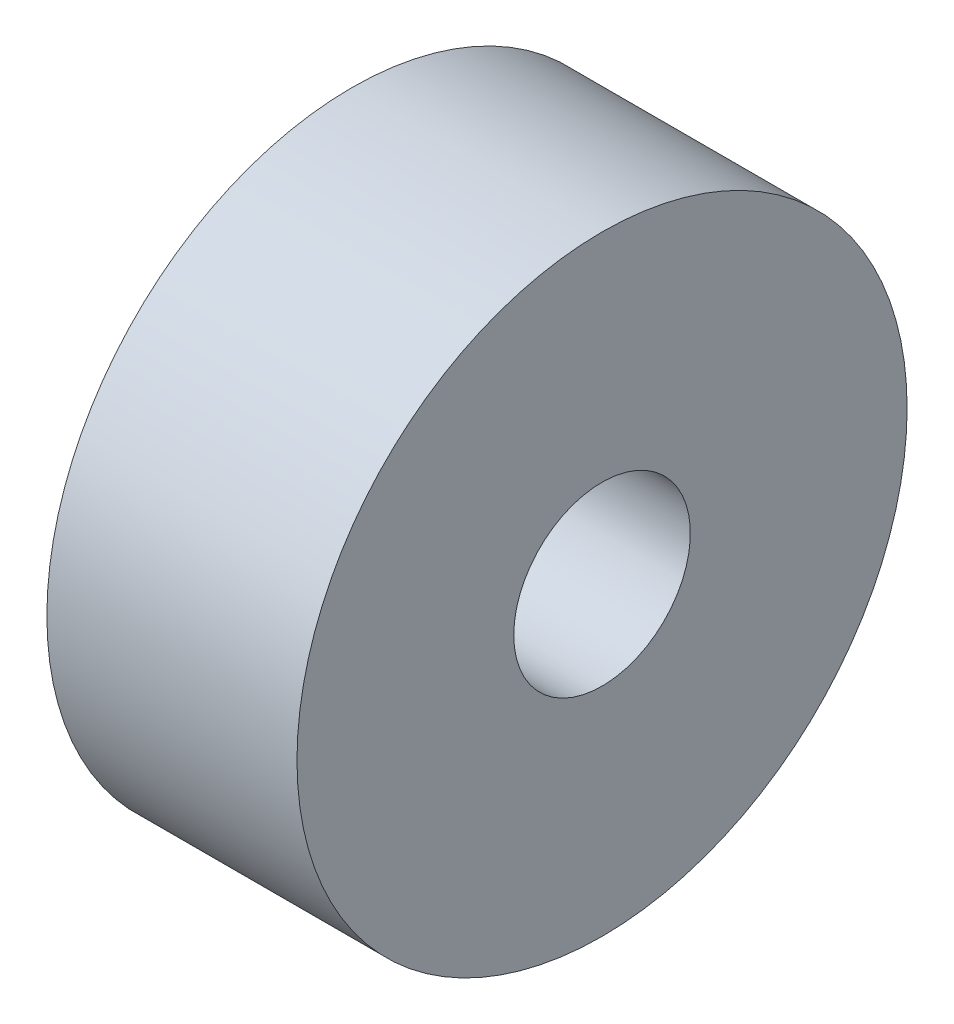
ISO-10303-21;
HEADER;
FILE_DESCRIPTION(('STEP AP214'),'2;1');
FILE_NAME('part.step','',(''),(''),'','','');
FILE_SCHEMA(('AUTOMOTIVE_DESIGN { 1 0 10303 214 1 1 1 1 }'));
ENDSEC;
DATA;
#1=APPLICATION_CONTEXT('core data for automotive mechanical design processes');
#2=APPLICATION_PROTOCOL_DEFINITION('international standard','automotive_design',2000,#1);
#3=PRODUCT_CONTEXT('',#1,'mechanical');
#4=PRODUCT('Part','Part','',(#3));
#5=PRODUCT_RELATED_PRODUCT_CATEGORY('part','',(#4));
#6=PRODUCT_DEFINITION_FORMATION('','',#4);
#7=PRODUCT_DEFINITION_CONTEXT('part definition',#1,'design');
#8=PRODUCT_DEFINITION('design','',#6,#7);
#9=PRODUCT_DEFINITION_SHAPE('','',#8);
#10=(LENGTH_UNIT() NAMED_UNIT(*) SI_UNIT(.MILLI.,.METRE.));
#11=(NAMED_UNIT(*) PLANE_ANGLE_UNIT() SI_UNIT($,.RADIAN.));
#12=(NAMED_UNIT(*) SI_UNIT($,.STERADIAN.) SOLID_ANGLE_UNIT());
#13=UNCERTAINTY_MEASURE_WITH_UNIT(LENGTH_MEASURE(1.E-05),#10,'distance_accuracy_value','');
#14=(GEOMETRIC_REPRESENTATION_CONTEXT(3) GLOBAL_UNCERTAINTY_ASSIGNED_CONTEXT((#13)) GLOBAL_UNIT_ASSIGNED_CONTEXT((#10,
#11,#12)) REPRESENTATION_CONTEXT('',''));
#15=CARTESIAN_POINT('',(0.,0.,0.));
#16=DIRECTION('',(0.,0.,1.));
#17=DIRECTION('',(1.,0.,0.));
#18=AXIS2_PLACEMENT_3D('',#15,#16,#17);
#19=CARTESIAN_POINT('',(0.,0.,0.));
#20=DIRECTION('',(1.,0.,0.));
#21=DIRECTION('',(0.,0.,-1.));
#22=AXIS2_PLACEMENT_3D('',#19,#20,#21);
#23=PLANE('',#22);
#24=CARTESIAN_POINT('',(0.,0.,0.));
#25=DIRECTION('',(-1.,0.,0.));
#26=DIRECTION('',(0.,0.,1.));
#27=AXIS2_PLACEMENT_3D('',#24,#25,#26);
#28=CIRCLE('',#27,1.5875);
#29=CARTESIAN_POINT('',(0.,0.,1.5875));
#30=VERTEX_POINT('',#29);
#31=EDGE_CURVE('E27',#30,#30,#28,.F.);
#32=ORIENTED_EDGE('',*,*,#31,.T.);
#33=EDGE_LOOP('',(#32));
#34=FACE_BOUND('',#33,.T.);
#35=CARTESIAN_POINT('',(0.,0.,0.));
#36=DIRECTION('',(-1.,0.,0.));
#37=DIRECTION('',(0.,0.,1.));
#38=AXIS2_PLACEMENT_3D('',#35,#36,#37);
#39=CIRCLE('',#38,5.4839997);
#40=CARTESIAN_POINT('',(0.,0.,5.4839997));
#41=VERTEX_POINT('',#40);
#42=EDGE_CURVE('E18',#41,#41,#39,.F.);
#43=ORIENTED_EDGE('',*,*,#42,.F.);
#44=EDGE_LOOP('',(#43));
#45=FACE_BOUND('',#44,.T.);
#46=ADVANCED_FACE('F15',(#34,#45),#23,.F.);
#47=CARTESIAN_POINT('',(4.4958,0.,0.));
#48=DIRECTION('',(-1.,0.,0.));
#49=DIRECTION('',(0.,0.,1.));
#50=AXIS2_PLACEMENT_3D('',#47,#48,#49);
#51=CYLINDRICAL_SURFACE('',#50,5.4839997);
#52=ORIENTED_EDGE('',*,*,#42,.T.);
#53=EDGE_LOOP('',(#52));
#54=FACE_BOUND('',#53,.T.);
#55=CARTESIAN_POINT('',(4.4958,0.,0.));
#56=DIRECTION('',(-1.,0.,0.));
#57=DIRECTION('',(0.,0.,1.));
#58=AXIS2_PLACEMENT_3D('',#55,#56,#57);
#59=CIRCLE('',#58,5.4839997);
#60=CARTESIAN_POINT('',(4.4958,0.,5.4839997));
#61=VERTEX_POINT('',#60);
#62=EDGE_CURVE('E22',#61,#61,#59,.F.);
#63=ORIENTED_EDGE('',*,*,#62,.F.);
#64=EDGE_LOOP('',(#63));
#65=FACE_BOUND('',#64,.T.);
#66=ADVANCED_FACE('F35',(#54,#65),#51,.T.);
#67=CARTESIAN_POINT('',(4.4958,0.,0.));
#68=DIRECTION('',(-1.,0.,0.));
#69=DIRECTION('',(0.,0.,1.));
#70=AXIS2_PLACEMENT_3D('',#67,#68,#69);
#71=CYLINDRICAL_SURFACE('',#70,1.5875);
#72=CARTESIAN_POINT('',(4.4958,0.,0.));
#73=DIRECTION('',(-1.,0.,0.));
#74=DIRECTION('',(0.,0.,1.));
#75=AXIS2_PLACEMENT_3D('',#72,#73,#74);
#76=CIRCLE('',#75,1.5875);
#77=CARTESIAN_POINT('',(4.4958,0.,1.5875));
#78=VERTEX_POINT('',#77);
#79=EDGE_CURVE('E10',#78,#78,#76,.T.);
#80=ORIENTED_EDGE('',*,*,#79,.F.);
#81=EDGE_LOOP('',(#80));
#82=FACE_BOUND('',#81,.T.);
#83=ORIENTED_EDGE('',*,*,#31,.F.);
#84=EDGE_LOOP('',(#83));
#85=FACE_BOUND('',#84,.T.);
#86=ADVANCED_FACE('F43',(#82,#85),#71,.F.);
#87=CARTESIAN_POINT('',(4.4958,0.,0.));
#88=DIRECTION('',(1.,0.,0.));
#89=DIRECTION('',(0.,0.,-1.));
#90=AXIS2_PLACEMENT_3D('',#87,#88,#89);
#91=PLANE('',#90);
#92=ORIENTED_EDGE('',*,*,#79,.T.);
#93=EDGE_LOOP('',(#92));
#94=FACE_BOUND('',#93,.T.);
#95=ORIENTED_EDGE('',*,*,#62,.T.);
#96=EDGE_LOOP('',(#95));
#97=FACE_BOUND('',#96,.T.);
#98=ADVANCED_FACE('F44',(#94,#97),#91,.T.);
#99=CLOSED_SHELL('',(#46,#66,#86,#98));
#100=MANIFOLD_SOLID_BREP('B1',#99);
#101=ADVANCED_BREP_SHAPE_REPRESENTATION('',(#18,#100),#14);
#102=SHAPE_DEFINITION_REPRESENTATION(#9,#101);
ENDSEC;
END-ISO-10303-21;
